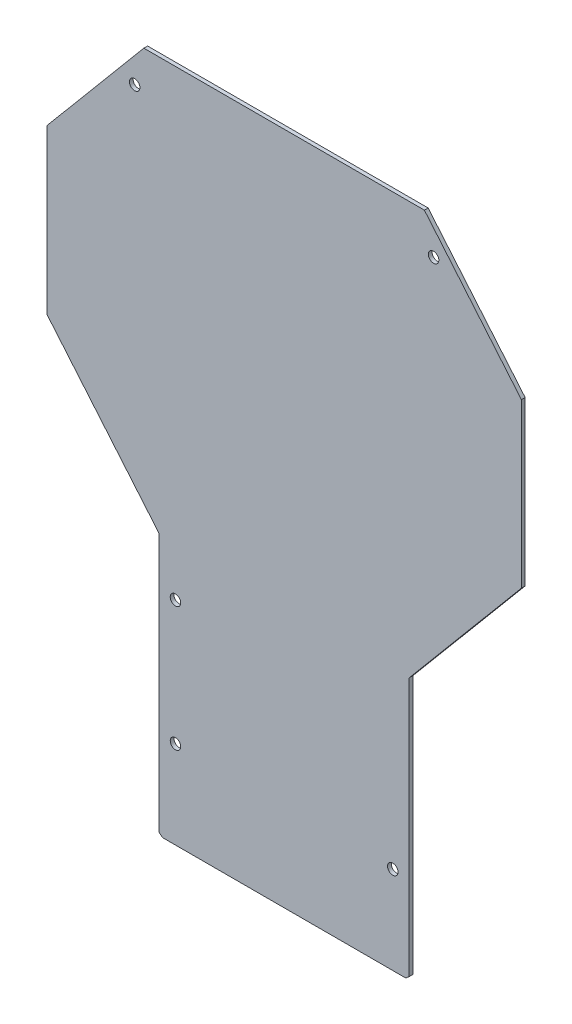
ISO-10303-21;
HEADER;
FILE_DESCRIPTION(('STEP AP214'),'2;1');
FILE_NAME('part.step','',(''),(''),'','','');
FILE_SCHEMA(('AUTOMOTIVE_DESIGN { 1 0 10303 214 1 1 1 1 }'));
ENDSEC;
DATA;
#1=APPLICATION_CONTEXT('core data for automotive mechanical design processes');
#2=APPLICATION_PROTOCOL_DEFINITION('international standard','automotive_design',2000,#1);
#3=PRODUCT_CONTEXT('',#1,'mechanical');
#4=PRODUCT('Part','Part','',(#3));
#5=PRODUCT_RELATED_PRODUCT_CATEGORY('part','',(#4));
#6=PRODUCT_DEFINITION_FORMATION('','',#4);
#7=PRODUCT_DEFINITION_CONTEXT('part definition',#1,'design');
#8=PRODUCT_DEFINITION('design','',#6,#7);
#9=PRODUCT_DEFINITION_SHAPE('','',#8);
#10=(LENGTH_UNIT() NAMED_UNIT(*) SI_UNIT(.MILLI.,.METRE.));
#11=(NAMED_UNIT(*) PLANE_ANGLE_UNIT() SI_UNIT($,.RADIAN.));
#12=(NAMED_UNIT(*) SI_UNIT($,.STERADIAN.) SOLID_ANGLE_UNIT());
#13=UNCERTAINTY_MEASURE_WITH_UNIT(LENGTH_MEASURE(1.E-05),#10,'distance_accuracy_value','');
#14=(GEOMETRIC_REPRESENTATION_CONTEXT(3) GLOBAL_UNCERTAINTY_ASSIGNED_CONTEXT((#13)) GLOBAL_UNIT_ASSIGNED_CONTEXT((#10,
#11,#12)) REPRESENTATION_CONTEXT('',''));
#15=CARTESIAN_POINT('',(0.,0.,0.));
#16=DIRECTION('',(0.,0.,1.));
#17=DIRECTION('',(1.,0.,0.));
#18=AXIS2_PLACEMENT_3D('',#15,#16,#17);
#19=CARTESIAN_POINT('',(49.1570232721275,-31.4887292628743,1.5));
#20=DIRECTION('',(-1.,0.,0.));
#21=DIRECTION('',(0.,-1.,0.));
#22=AXIS2_PLACEMENT_3D('',#19,#20,#21);
#23=PLANE('',#22);
#24=DIRECTION('',(0.,1.,0.));
#25=VECTOR('',#24,1.);
#26=CARTESIAN_POINT('',(49.1570232721275,-31.4887292628743,0.));
#27=LINE('',#26,#25);
#28=CARTESIAN_POINT('',(49.1570232721276,-135.082673957974,0.));
#29=VERTEX_POINT('',#28);
#30=CARTESIAN_POINT('',(49.1570232721275,-31.4887292628743,0.));
#31=VERTEX_POINT('',#30);
#32=EDGE_CURVE('E152',#29,#31,#27,.T.);
#33=ORIENTED_EDGE('',*,*,#32,.T.);
#34=DIRECTION('',(0.,0.,-1.));
#35=VECTOR('',#34,1.);
#36=CARTESIAN_POINT('',(49.1570232721275,-31.4887292628743,1.5));
#37=LINE('',#36,#35);
#38=CARTESIAN_POINT('',(49.1570232721275,-31.4887292628743,1.5));
#39=VERTEX_POINT('',#38);
#40=EDGE_CURVE('E11',#39,#31,#37,.T.);
#41=ORIENTED_EDGE('',*,*,#40,.F.);
#42=DIRECTION('',(0.,1.,0.));
#43=VECTOR('',#42,1.);
#44=CARTESIAN_POINT('',(49.1570232721275,-31.4887292628743,1.5));
#45=LINE('',#44,#43);
#46=CARTESIAN_POINT('',(49.1570232721276,-135.082673957974,1.5));
#47=VERTEX_POINT('',#46);
#48=EDGE_CURVE('E175',#47,#39,#45,.T.);
#49=ORIENTED_EDGE('',*,*,#48,.F.);
#50=DIRECTION('',(0.,0.,-1.));
#51=VECTOR('',#50,1.);
#52=CARTESIAN_POINT('',(49.1570232721276,-135.082673957974,1.5));
#53=LINE('',#52,#51);
#54=EDGE_CURVE('E148',#47,#29,#53,.T.);
#55=ORIENTED_EDGE('',*,*,#54,.T.);
#56=EDGE_LOOP('',(#33,#41,#49,#55));
#57=FACE_BOUND('',#56,.T.);
#58=ADVANCED_FACE('F32',(#57),#23,.F.);
#59=CARTESIAN_POINT('',(94.1570232721273,22.1401824038646,1.5));
#60=DIRECTION('',(-0.766044443118977,0.642787609686541,0.));
#61=DIRECTION('',(-0.642787609686541,-0.766044443118977,0.));
#62=AXIS2_PLACEMENT_3D('',#59,#60,#61);
#63=PLANE('',#62);
#64=DIRECTION('',(0.642787609686541,0.766044443118977,0.));
#65=VECTOR('',#64,1.);
#66=CARTESIAN_POINT('',(94.1570232721273,22.1401824038646,0.));
#67=LINE('',#66,#65);
#68=CARTESIAN_POINT('',(94.1570232721273,22.1401824038646,0.));
#69=VERTEX_POINT('',#68);
#70=EDGE_CURVE('E155',#31,#69,#67,.T.);
#71=ORIENTED_EDGE('',*,*,#70,.T.);
#72=DIRECTION('',(0.,0.,-1.));
#73=VECTOR('',#72,1.);
#74=CARTESIAN_POINT('',(94.1570232721273,22.1401824038646,1.5));
#75=LINE('',#74,#73);
#76=CARTESIAN_POINT('',(94.1570232721273,22.1401824038646,1.5));
#77=VERTEX_POINT('',#76);
#78=EDGE_CURVE('E40',#77,#69,#75,.T.);
#79=ORIENTED_EDGE('',*,*,#78,.F.);
#80=DIRECTION('',(0.642787609686541,0.766044443118977,0.));
#81=VECTOR('',#80,1.);
#82=CARTESIAN_POINT('',(94.1570232721273,22.1401824038646,1.5));
#83=LINE('',#82,#81);
#84=EDGE_CURVE('E103',#39,#77,#83,.T.);
#85=ORIENTED_EDGE('',*,*,#84,.F.);
#86=ORIENTED_EDGE('',*,*,#40,.T.);
#87=EDGE_LOOP('',(#71,#79,#85,#86));
#88=FACE_BOUND('',#87,.T.);
#89=ADVANCED_FACE('F254',(#88),#63,.F.);
#90=CARTESIAN_POINT('',(94.1570232721273,87.5266959780915,1.5));
#91=DIRECTION('',(-1.,0.,0.));
#92=DIRECTION('',(0.,-1.,0.));
#93=AXIS2_PLACEMENT_3D('',#90,#91,#92);
#94=PLANE('',#93);
#95=DIRECTION('',(0.,1.,0.));
#96=VECTOR('',#95,1.);
#97=CARTESIAN_POINT('',(94.1570232721273,87.5266959780915,0.));
#98=LINE('',#97,#96);
#99=CARTESIAN_POINT('',(94.1570232721273,87.5266959780915,0.));
#100=VERTEX_POINT('',#99);
#101=EDGE_CURVE('E158',#69,#100,#98,.T.);
#102=ORIENTED_EDGE('',*,*,#101,.T.);
#103=DIRECTION('',(0.,0.,-1.));
#104=VECTOR('',#103,1.);
#105=CARTESIAN_POINT('',(94.1570232721273,87.5266959780915,1.5));
#106=LINE('',#105,#104);
#107=CARTESIAN_POINT('',(94.1570232721273,87.5266959780915,1.5));
#108=VERTEX_POINT('',#107);
#109=EDGE_CURVE('E194',#108,#100,#106,.T.);
#110=ORIENTED_EDGE('',*,*,#109,.F.);
#111=DIRECTION('',(0.,1.,0.));
#112=VECTOR('',#111,1.);
#113=CARTESIAN_POINT('',(94.1570232721273,87.5266959780915,1.5));
#114=LINE('',#113,#112);
#115=EDGE_CURVE('E202',#77,#108,#114,.T.);
#116=ORIENTED_EDGE('',*,*,#115,.F.);
#117=ORIENTED_EDGE('',*,*,#78,.T.);
#118=EDGE_LOOP('',(#102,#110,#116,#117));
#119=FACE_BOUND('',#118,.T.);
#120=ADVANCED_FACE('F200',(#119),#94,.F.);
#121=CARTESIAN_POINT('',(55.3210460022655,133.809611411357,1.5));
#122=DIRECTION('',(-0.766044443118982,-0.642787609686534,0.));
#123=DIRECTION('',(0.642787609686534,-0.766044443118983,0.));
#124=AXIS2_PLACEMENT_3D('',#121,#122,#123);
#125=PLANE('',#124);
#126=DIRECTION('',(-0.642787609686534,0.766044443118982,0.));
#127=VECTOR('',#126,1.);
#128=CARTESIAN_POINT('',(55.3210460022655,133.809611411357,0.));
#129=LINE('',#128,#127);
#130=CARTESIAN_POINT('',(55.3210460022655,133.809611411357,0.));
#131=VERTEX_POINT('',#130);
#132=EDGE_CURVE('E160',#100,#131,#129,.T.);
#133=ORIENTED_EDGE('',*,*,#132,.T.);
#134=DIRECTION('',(0.,0.,-1.));
#135=VECTOR('',#134,1.);
#136=CARTESIAN_POINT('',(55.3210460022655,133.809611411357,1.5));
#137=LINE('',#136,#135);
#138=CARTESIAN_POINT('',(55.3210460022655,133.809611411357,1.5));
#139=VERTEX_POINT('',#138);
#140=EDGE_CURVE('E191',#139,#131,#137,.T.);
#141=ORIENTED_EDGE('',*,*,#140,.F.);
#142=DIRECTION('',(-0.642787609686534,0.766044443118982,0.));
#143=VECTOR('',#142,1.);
#144=CARTESIAN_POINT('',(55.3210460022655,133.809611411357,1.5));
#145=LINE('',#144,#143);
#146=EDGE_CURVE('E220',#108,#139,#145,.T.);
#147=ORIENTED_EDGE('',*,*,#146,.F.);
#148=ORIENTED_EDGE('',*,*,#109,.T.);
#149=EDGE_LOOP('',(#133,#141,#147,#148));
#150=FACE_BOUND('',#149,.T.);
#151=ADVANCED_FACE('F211',(#150),#125,.F.);
#152=CARTESIAN_POINT('',(55.3210460022655,133.809611411357,1.5));
#153=DIRECTION('',(0.,-1.,0.));
#154=DIRECTION('',(0.,0.,-1.));
#155=AXIS2_PLACEMENT_3D('',#152,#153,#154);
#156=PLANE('',#155);
#157=DIRECTION('',(-1.,0.,0.));
#158=VECTOR('',#157,1.);
#159=CARTESIAN_POINT('',(55.3210460022655,133.809611411357,0.));
#160=LINE('',#159,#158);
#161=CARTESIAN_POINT('',(-57.0069994580103,133.809611411357,0.));
#162=VERTEX_POINT('',#161);
#163=EDGE_CURVE('E162',#131,#162,#160,.T.);
#164=ORIENTED_EDGE('',*,*,#163,.T.);
#165=DIRECTION('',(0.,0.,-1.));
#166=VECTOR('',#165,1.);
#167=CARTESIAN_POINT('',(-57.0069994580103,133.809611411357,1.5));
#168=LINE('',#167,#166);
#169=CARTESIAN_POINT('',(-57.0069994580103,133.809611411357,1.5));
#170=VERTEX_POINT('',#169);
#171=EDGE_CURVE('E188',#170,#162,#168,.T.);
#172=ORIENTED_EDGE('',*,*,#171,.F.);
#173=DIRECTION('',(-1.,0.,0.));
#174=VECTOR('',#173,1.);
#175=CARTESIAN_POINT('',(55.3210460022655,133.809611411357,1.5));
#176=LINE('',#175,#174);
#177=EDGE_CURVE('E217',#139,#170,#176,.T.);
#178=ORIENTED_EDGE('',*,*,#177,.F.);
#179=ORIENTED_EDGE('',*,*,#140,.T.);
#180=EDGE_LOOP('',(#164,#172,#178,#179));
#181=FACE_BOUND('',#180,.T.);
#182=ADVANCED_FACE('F215',(#181),#156,.F.);
#183=CARTESIAN_POINT('',(-57.0069994580103,133.809611411357,1.5));
#184=DIRECTION('',(0.766044443118982,-0.642787609686534,0.));
#185=DIRECTION('',(0.642787609686534,0.766044443118983,0.));
#186=AXIS2_PLACEMENT_3D('',#183,#184,#185);
#187=PLANE('',#186);
#188=DIRECTION('',(-0.642787609686534,-0.766044443118982,0.));
#189=VECTOR('',#188,1.);
#190=CARTESIAN_POINT('',(-57.0069994580103,133.809611411357,0.));
#191=LINE('',#190,#189);
#192=CARTESIAN_POINT('',(-95.8429767278721,87.5266959780915,0.));
#193=VERTEX_POINT('',#192);
#194=EDGE_CURVE('E164',#162,#193,#191,.T.);
#195=ORIENTED_EDGE('',*,*,#194,.T.);
#196=DIRECTION('',(0.,0.,-1.));
#197=VECTOR('',#196,1.);
#198=CARTESIAN_POINT('',(-95.8429767278721,87.5266959780915,1.5));
#199=LINE('',#198,#197);
#200=CARTESIAN_POINT('',(-95.8429767278721,87.5266959780915,1.5));
#201=VERTEX_POINT('',#200);
#202=EDGE_CURVE('E185',#201,#193,#199,.T.);
#203=ORIENTED_EDGE('',*,*,#202,.F.);
#204=DIRECTION('',(-0.642787609686534,-0.766044443118982,0.));
#205=VECTOR('',#204,1.);
#206=CARTESIAN_POINT('',(-57.0069994580103,133.809611411357,1.5));
#207=LINE('',#206,#205);
#208=EDGE_CURVE('E219',#170,#201,#207,.T.);
#209=ORIENTED_EDGE('',*,*,#208,.F.);
#210=ORIENTED_EDGE('',*,*,#171,.T.);
#211=EDGE_LOOP('',(#195,#203,#209,#210));
#212=FACE_BOUND('',#211,.T.);
#213=ADVANCED_FACE('F267',(#212),#187,.F.);
#214=CARTESIAN_POINT('',(-95.8429767278721,87.5266959780915,1.5));
#215=DIRECTION('',(1.,0.,0.));
#216=DIRECTION('',(0.,1.,0.));
#217=AXIS2_PLACEMENT_3D('',#214,#215,#216);
#218=PLANE('',#217);
#219=DIRECTION('',(0.,-1.,0.));
#220=VECTOR('',#219,1.);
#221=CARTESIAN_POINT('',(-95.8429767278721,87.5266959780915,0.));
#222=LINE('',#221,#220);
#223=CARTESIAN_POINT('',(-95.8429767278721,22.1401824038646,0.));
#224=VERTEX_POINT('',#223);
#225=EDGE_CURVE('E166',#193,#224,#222,.T.);
#226=ORIENTED_EDGE('',*,*,#225,.T.);
#227=DIRECTION('',(0.,0.,-1.));
#228=VECTOR('',#227,1.);
#229=CARTESIAN_POINT('',(-95.8429767278721,22.1401824038646,1.5));
#230=LINE('',#229,#228);
#231=CARTESIAN_POINT('',(-95.8429767278721,22.1401824038646,1.5));
#232=VERTEX_POINT('',#231);
#233=EDGE_CURVE('E182',#232,#224,#230,.T.);
#234=ORIENTED_EDGE('',*,*,#233,.F.);
#235=DIRECTION('',(0.,-1.,0.));
#236=VECTOR('',#235,1.);
#237=CARTESIAN_POINT('',(-95.8429767278721,87.5266959780915,1.5));
#238=LINE('',#237,#236);
#239=EDGE_CURVE('E222',#201,#232,#238,.T.);
#240=ORIENTED_EDGE('',*,*,#239,.F.);
#241=ORIENTED_EDGE('',*,*,#202,.T.);
#242=EDGE_LOOP('',(#226,#234,#240,#241));
#243=FACE_BOUND('',#242,.T.);
#244=ADVANCED_FACE('F270',(#243),#218,.F.);
#245=CARTESIAN_POINT('',(-95.8429767278721,22.1401824038646,1.5));
#246=DIRECTION('',(0.766044443118977,0.642787609686541,0.));
#247=DIRECTION('',(-0.642787609686541,0.766044443118977,0.));
#248=AXIS2_PLACEMENT_3D('',#245,#246,#247);
#249=PLANE('',#248);
#250=DIRECTION('',(0.642787609686541,-0.766044443118977,0.));
#251=VECTOR('',#250,1.);
#252=CARTESIAN_POINT('',(-95.8429767278721,22.1401824038646,0.));
#253=LINE('',#252,#251);
#254=CARTESIAN_POINT('',(-50.8429767278723,-31.4887292628743,0.));
#255=VERTEX_POINT('',#254);
#256=EDGE_CURVE('E168',#224,#255,#253,.T.);
#257=ORIENTED_EDGE('',*,*,#256,.T.);
#258=DIRECTION('',(0.,0.,-1.));
#259=VECTOR('',#258,1.);
#260=CARTESIAN_POINT('',(-50.8429767278723,-31.4887292628743,1.5));
#261=LINE('',#260,#259);
#262=CARTESIAN_POINT('',(-50.8429767278723,-31.4887292628743,1.5));
#263=VERTEX_POINT('',#262);
#264=EDGE_CURVE('E179',#263,#255,#261,.T.);
#265=ORIENTED_EDGE('',*,*,#264,.F.);
#266=DIRECTION('',(0.642787609686541,-0.766044443118977,0.));
#267=VECTOR('',#266,1.);
#268=CARTESIAN_POINT('',(-95.8429767278721,22.1401824038646,1.5));
#269=LINE('',#268,#267);
#270=EDGE_CURVE('E228',#232,#263,#269,.T.);
#271=ORIENTED_EDGE('',*,*,#270,.F.);
#272=ORIENTED_EDGE('',*,*,#233,.T.);
#273=EDGE_LOOP('',(#257,#265,#271,#272));
#274=FACE_BOUND('',#273,.T.);
#275=ADVANCED_FACE('F234',(#274),#249,.F.);
#276=CARTESIAN_POINT('',(-50.8429767278723,-31.4887292628743,1.5));
#277=DIRECTION('',(1.,0.,0.));
#278=DIRECTION('',(0.,1.,0.));
#279=AXIS2_PLACEMENT_3D('',#276,#277,#278);
#280=PLANE('',#279);
#281=DIRECTION('',(0.,-1.,0.));
#282=VECTOR('',#281,1.);
#283=CARTESIAN_POINT('',(-50.8429767278723,-31.4887292628743,0.));
#284=LINE('',#283,#282);
#285=CARTESIAN_POINT('',(-50.8429767278723,-135.082673957974,0.));
#286=VERTEX_POINT('',#285);
#287=EDGE_CURVE('E170',#255,#286,#284,.T.);
#288=ORIENTED_EDGE('',*,*,#287,.T.);
#289=DIRECTION('',(0.,0.,-1.));
#290=VECTOR('',#289,1.);
#291=CARTESIAN_POINT('',(-50.8429767278723,-135.082673957974,1.5));
#292=LINE('',#291,#290);
#293=CARTESIAN_POINT('',(-50.8429767278723,-135.082673957974,1.5));
#294=VERTEX_POINT('',#293);
#295=EDGE_CURVE('E143',#294,#286,#292,.T.);
#296=ORIENTED_EDGE('',*,*,#295,.F.);
#297=DIRECTION('',(0.,-1.,0.));
#298=VECTOR('',#297,1.);
#299=CARTESIAN_POINT('',(-50.8429767278723,-31.4887292628743,1.5));
#300=LINE('',#299,#298);
#301=EDGE_CURVE('E134',#263,#294,#300,.T.);
#302=ORIENTED_EDGE('',*,*,#301,.F.);
#303=ORIENTED_EDGE('',*,*,#264,.T.);
#304=EDGE_LOOP('',(#288,#296,#302,#303));
#305=FACE_BOUND('',#304,.T.);
#306=ADVANCED_FACE('F238',(#305),#280,.F.);
#307=CARTESIAN_POINT('',(-50.8429767278723,-135.082673957974,1.5));
#308=DIRECTION('',(0.642787609686518,0.766044443118996,0.));
#309=DIRECTION('',(-0.766044443118996,0.642787609686518,0.));
#310=AXIS2_PLACEMENT_3D('',#307,#308,#309);
#311=PLANE('',#310);
#312=DIRECTION('',(0.766044443118996,-0.642787609686518,0.));
#313=VECTOR('',#312,1.);
#314=CARTESIAN_POINT('',(-50.8429767278723,-135.082673957974,0.));
#315=LINE('',#314,#313);
#316=CARTESIAN_POINT('',(-49.5228538372032,-136.190388588643,0.));
#317=VERTEX_POINT('',#316);
#318=EDGE_CURVE('E142',#286,#317,#315,.T.);
#319=ORIENTED_EDGE('',*,*,#318,.T.);
#320=DIRECTION('',(0.,0.,-1.));
#321=VECTOR('',#320,1.);
#322=CARTESIAN_POINT('',(-49.5228538372032,-136.190388588643,1.5));
#323=LINE('',#322,#321);
#324=CARTESIAN_POINT('',(-49.5228538372032,-136.190388588643,1.5));
#325=VERTEX_POINT('',#324);
#326=EDGE_CURVE('E139',#325,#317,#323,.T.);
#327=ORIENTED_EDGE('',*,*,#326,.F.);
#328=DIRECTION('',(0.766044443118996,-0.642787609686518,0.));
#329=VECTOR('',#328,1.);
#330=CARTESIAN_POINT('',(-50.8429767278723,-135.082673957974,1.5));
#331=LINE('',#330,#329);
#332=EDGE_CURVE('E128',#294,#325,#331,.T.);
#333=ORIENTED_EDGE('',*,*,#332,.F.);
#334=ORIENTED_EDGE('',*,*,#295,.T.);
#335=EDGE_LOOP('',(#319,#327,#333,#334));
#336=FACE_BOUND('',#335,.T.);
#337=ADVANCED_FACE('F140',(#336),#311,.F.);
#338=CARTESIAN_POINT('',(-49.5228538372032,-136.190388588643,1.5));
#339=DIRECTION('',(0.,1.,0.));
#340=DIRECTION('',(-1.,0.,0.));
#341=AXIS2_PLACEMENT_3D('',#338,#339,#340);
#342=PLANE('',#341);
#343=DIRECTION('',(1.,0.,0.));
#344=VECTOR('',#343,1.);
#345=CARTESIAN_POINT('',(-49.5228538372032,-136.190388588643,0.));
#346=LINE('',#345,#344);
#347=CARTESIAN_POINT('',(47.8369003814585,-136.190388588643,0.));
#348=VERTEX_POINT('',#347);
#349=EDGE_CURVE('E89',#317,#348,#346,.T.);
#350=ORIENTED_EDGE('',*,*,#349,.T.);
#351=DIRECTION('',(0.,0.,-1.));
#352=VECTOR('',#351,1.);
#353=CARTESIAN_POINT('',(47.8369003814585,-136.190388588643,1.5));
#354=LINE('',#353,#352);
#355=CARTESIAN_POINT('',(47.8369003814585,-136.190388588643,1.5));
#356=VERTEX_POINT('',#355);
#357=EDGE_CURVE('E144',#356,#348,#354,.T.);
#358=ORIENTED_EDGE('',*,*,#357,.F.);
#359=DIRECTION('',(1.,0.,0.));
#360=VECTOR('',#359,1.);
#361=CARTESIAN_POINT('',(-49.5228538372032,-136.190388588643,1.5));
#362=LINE('',#361,#360);
#363=EDGE_CURVE('E132',#325,#356,#362,.T.);
#364=ORIENTED_EDGE('',*,*,#363,.F.);
#365=ORIENTED_EDGE('',*,*,#326,.T.);
#366=EDGE_LOOP('',(#350,#358,#364,#365));
#367=FACE_BOUND('',#366,.T.);
#368=ADVANCED_FACE('F146',(#367),#342,.F.);
#369=CARTESIAN_POINT('',(49.1570232721276,-135.082673957974,1.5));
#370=DIRECTION('',(-0.642787609686531,0.766044443118985,0.));
#371=DIRECTION('',(-0.766044443118985,-0.642787609686531,0.));
#372=AXIS2_PLACEMENT_3D('',#369,#370,#371);
#373=PLANE('',#372);
#374=DIRECTION('',(0.766044443118985,0.642787609686531,0.));
#375=VECTOR('',#374,1.);
#376=CARTESIAN_POINT('',(49.1570232721276,-135.082673957974,0.));
#377=LINE('',#376,#375);
#378=EDGE_CURVE('E95',#348,#29,#377,.T.);
#379=ORIENTED_EDGE('',*,*,#378,.T.);
#380=ORIENTED_EDGE('',*,*,#54,.F.);
#381=DIRECTION('',(0.766044443118985,0.642787609686531,0.));
#382=VECTOR('',#381,1.);
#383=CARTESIAN_POINT('',(49.1570232721276,-135.082673957974,1.5));
#384=LINE('',#383,#382);
#385=EDGE_CURVE('E48',#356,#47,#384,.T.);
#386=ORIENTED_EDGE('',*,*,#385,.F.);
#387=ORIENTED_EDGE('',*,*,#357,.T.);
#388=EDGE_LOOP('',(#379,#380,#386,#387));
#389=FACE_BOUND('',#388,.T.);
#390=ADVANCED_FACE('F242',(#389),#373,.F.);
#391=CARTESIAN_POINT('',(0.,0.,1.5));
#392=DIRECTION('',(0.,0.,1.));
#393=DIRECTION('',(1.,0.,0.));
#394=AXIS2_PLACEMENT_3D('',#391,#392,#393);
#395=PLANE('',#394);
#396=CARTESIAN_POINT('',(-44.3429767278723,-51.1903885886428,1.5));
#397=DIRECTION('',(0.,0.,1.));
#398=DIRECTION('',(1.,0.,0.));
#399=AXIS2_PLACEMENT_3D('',#396,#397,#398);
#400=CIRCLE('',#399,2.1);
#401=CARTESIAN_POINT('',(-42.2429767278723,-51.1903885886428,1.5));
#402=VERTEX_POINT('',#401);
#403=EDGE_CURVE('E363',#402,#402,#400,.T.);
#404=ORIENTED_EDGE('',*,*,#403,.F.);
#405=EDGE_LOOP('',(#404));
#406=FACE_BOUND('',#405,.T.);
#407=CARTESIAN_POINT('',(58.9989798659813,119.314215641357,1.5));
#408=DIRECTION('',(0.,0.,1.));
#409=DIRECTION('',(-1.,0.,0.));
#410=AXIS2_PLACEMENT_3D('',#407,#408,#409);
#411=CIRCLE('',#410,2.09999999999997);
#412=CARTESIAN_POINT('',(56.8989798659813,119.314215641357,1.5));
#413=VERTEX_POINT('',#412);
#414=EDGE_CURVE('E367',#413,#413,#411,.T.);
#415=ORIENTED_EDGE('',*,*,#414,.F.);
#416=EDGE_LOOP('',(#415));
#417=FACE_BOUND('',#416,.T.);
#418=CARTESIAN_POINT('',(-44.3429767278723,-101.030388588643,1.5));
#419=DIRECTION('',(0.,0.,1.));
#420=DIRECTION('',(1.,0.,0.));
#421=AXIS2_PLACEMENT_3D('',#418,#419,#420);
#422=CIRCLE('',#421,2.1);
#423=CARTESIAN_POINT('',(-42.2429767278723,-101.030388588643,1.5));
#424=VERTEX_POINT('',#423);
#425=EDGE_CURVE('E376',#424,#424,#422,.T.);
#426=ORIENTED_EDGE('',*,*,#425,.F.);
#427=EDGE_LOOP('',(#426));
#428=FACE_BOUND('',#427,.T.);
#429=CARTESIAN_POINT('',(-60.684933321726,119.314215641357,1.5));
#430=DIRECTION('',(0.,0.,1.));
#431=DIRECTION('',(1.,0.,0.));
#432=AXIS2_PLACEMENT_3D('',#429,#430,#431);
#433=CIRCLE('',#432,2.1);
#434=CARTESIAN_POINT('',(-58.584933321726,119.314215641357,1.5));
#435=VERTEX_POINT('',#434);
#436=EDGE_CURVE('E382',#435,#435,#433,.T.);
#437=ORIENTED_EDGE('',*,*,#436,.F.);
#438=EDGE_LOOP('',(#437));
#439=FACE_BOUND('',#438,.T.);
#440=CARTESIAN_POINT('',(42.6570232721276,-101.030388588643,1.5));
#441=DIRECTION('',(0.,0.,1.));
#442=DIRECTION('',(-1.,0.,0.));
#443=AXIS2_PLACEMENT_3D('',#440,#441,#442);
#444=CIRCLE('',#443,2.1);
#445=CARTESIAN_POINT('',(40.5570232721276,-101.030388588643,1.5));
#446=VERTEX_POINT('',#445);
#447=EDGE_CURVE('E388',#446,#446,#444,.T.);
#448=ORIENTED_EDGE('',*,*,#447,.F.);
#449=EDGE_LOOP('',(#448));
#450=FACE_BOUND('',#449,.T.);
#451=ORIENTED_EDGE('',*,*,#48,.T.);
#452=ORIENTED_EDGE('',*,*,#84,.T.);
#453=ORIENTED_EDGE('',*,*,#115,.T.);
#454=ORIENTED_EDGE('',*,*,#146,.T.);
#455=ORIENTED_EDGE('',*,*,#177,.T.);
#456=ORIENTED_EDGE('',*,*,#208,.T.);
#457=ORIENTED_EDGE('',*,*,#239,.T.);
#458=ORIENTED_EDGE('',*,*,#270,.T.);
#459=ORIENTED_EDGE('',*,*,#301,.T.);
#460=ORIENTED_EDGE('',*,*,#332,.T.);
#461=ORIENTED_EDGE('',*,*,#363,.T.);
#462=ORIENTED_EDGE('',*,*,#385,.T.);
#463=EDGE_LOOP('',(#451,#452,#453,#454,#455,#456,#457,#458,#459,#460,#461,#462));
#464=FACE_BOUND('',#463,.T.);
#465=ADVANCED_FACE('F130',(#406,#417,#428,#439,#450,#464),#395,.T.);
#466=CARTESIAN_POINT('',(0.,0.,0.));
#467=DIRECTION('',(0.,0.,1.));
#468=DIRECTION('',(1.,0.,0.));
#469=AXIS2_PLACEMENT_3D('',#466,#467,#468);
#470=PLANE('',#469);
#471=CARTESIAN_POINT('',(-44.3429767278723,-51.1903885886428,0.));
#472=DIRECTION('',(0.,0.,1.));
#473=DIRECTION('',(1.,0.,0.));
#474=AXIS2_PLACEMENT_3D('',#471,#472,#473);
#475=CIRCLE('',#474,2.1);
#476=CARTESIAN_POINT('',(-42.2429767278723,-51.1903885886428,0.));
#477=VERTEX_POINT('',#476);
#478=EDGE_CURVE('E366',#477,#477,#475,.F.);
#479=ORIENTED_EDGE('',*,*,#478,.F.);
#480=EDGE_LOOP('',(#479));
#481=FACE_BOUND('',#480,.T.);
#482=CARTESIAN_POINT('',(58.9989798659813,119.314215641357,0.));
#483=DIRECTION('',(0.,0.,1.));
#484=DIRECTION('',(1.,0.,0.));
#485=AXIS2_PLACEMENT_3D('',#482,#483,#484);
#486=CIRCLE('',#485,2.09999999999997);
#487=CARTESIAN_POINT('',(61.0989798659813,119.314215641357,0.));
#488=VERTEX_POINT('',#487);
#489=EDGE_CURVE('E370',#488,#488,#486,.F.);
#490=ORIENTED_EDGE('',*,*,#489,.F.);
#491=EDGE_LOOP('',(#490));
#492=FACE_BOUND('',#491,.T.);
#493=CARTESIAN_POINT('',(-44.3429767278723,-101.030388588643,0.));
#494=DIRECTION('',(0.,0.,1.));
#495=DIRECTION('',(1.,0.,0.));
#496=AXIS2_PLACEMENT_3D('',#493,#494,#495);
#497=CIRCLE('',#496,2.1);
#498=CARTESIAN_POINT('',(-42.2429767278723,-101.030388588643,0.));
#499=VERTEX_POINT('',#498);
#500=EDGE_CURVE('E379',#499,#499,#497,.F.);
#501=ORIENTED_EDGE('',*,*,#500,.F.);
#502=EDGE_LOOP('',(#501));
#503=FACE_BOUND('',#502,.T.);
#504=CARTESIAN_POINT('',(-60.684933321726,119.314215641357,0.));
#505=DIRECTION('',(0.,0.,1.));
#506=DIRECTION('',(1.,0.,0.));
#507=AXIS2_PLACEMENT_3D('',#504,#505,#506);
#508=CIRCLE('',#507,2.1);
#509=CARTESIAN_POINT('',(-58.584933321726,119.314215641357,0.));
#510=VERTEX_POINT('',#509);
#511=EDGE_CURVE('E385',#510,#510,#508,.F.);
#512=ORIENTED_EDGE('',*,*,#511,.F.);
#513=EDGE_LOOP('',(#512));
#514=FACE_BOUND('',#513,.T.);
#515=CARTESIAN_POINT('',(42.6570232721276,-101.030388588643,0.));
#516=DIRECTION('',(0.,0.,1.));
#517=DIRECTION('',(1.,0.,0.));
#518=AXIS2_PLACEMENT_3D('',#515,#516,#517);
#519=CIRCLE('',#518,2.1);
#520=CARTESIAN_POINT('',(44.7570232721276,-101.030388588643,0.));
#521=VERTEX_POINT('',#520);
#522=EDGE_CURVE('E156',#521,#521,#519,.F.);
#523=ORIENTED_EDGE('',*,*,#522,.F.);
#524=EDGE_LOOP('',(#523));
#525=FACE_BOUND('',#524,.T.);
#526=ORIENTED_EDGE('',*,*,#32,.F.);
#527=ORIENTED_EDGE('',*,*,#378,.F.);
#528=ORIENTED_EDGE('',*,*,#349,.F.);
#529=ORIENTED_EDGE('',*,*,#318,.F.);
#530=ORIENTED_EDGE('',*,*,#287,.F.);
#531=ORIENTED_EDGE('',*,*,#256,.F.);
#532=ORIENTED_EDGE('',*,*,#225,.F.);
#533=ORIENTED_EDGE('',*,*,#194,.F.);
#534=ORIENTED_EDGE('',*,*,#163,.F.);
#535=ORIENTED_EDGE('',*,*,#132,.F.);
#536=ORIENTED_EDGE('',*,*,#101,.F.);
#537=ORIENTED_EDGE('',*,*,#70,.F.);
#538=EDGE_LOOP('',(#526,#527,#528,#529,#530,#531,#532,#533,#534,#535,#536,#537));
#539=FACE_BOUND('',#538,.T.);
#540=ADVANCED_FACE('F206',(#481,#492,#503,#514,#525,#539),#470,.F.);
#541=CARTESIAN_POINT('',(42.6570232721276,-101.030388588643,-0.000999999999999916));
#542=DIRECTION('',(0.,0.,1.));
#543=DIRECTION('',(1.,0.,0.));
#544=AXIS2_PLACEMENT_3D('',#541,#542,#543);
#545=CYLINDRICAL_SURFACE('',#544,2.1);
#546=ORIENTED_EDGE('',*,*,#447,.T.);
#547=EDGE_LOOP('',(#546));
#548=FACE_BOUND('',#547,.T.);
#549=ORIENTED_EDGE('',*,*,#522,.T.);
#550=EDGE_LOOP('',(#549));
#551=FACE_BOUND('',#550,.T.);
#552=ADVANCED_FACE('F307',(#548,#551),#545,.F.);
#553=CARTESIAN_POINT('',(-60.684933321726,119.314215641357,-0.000999999999999916));
#554=DIRECTION('',(0.,0.,1.));
#555=DIRECTION('',(1.,0.,0.));
#556=AXIS2_PLACEMENT_3D('',#553,#554,#555);
#557=CYLINDRICAL_SURFACE('',#556,2.1);
#558=ORIENTED_EDGE('',*,*,#436,.T.);
#559=EDGE_LOOP('',(#558));
#560=FACE_BOUND('',#559,.T.);
#561=ORIENTED_EDGE('',*,*,#511,.T.);
#562=EDGE_LOOP('',(#561));
#563=FACE_BOUND('',#562,.T.);
#564=ADVANCED_FACE('F316',(#560,#563),#557,.F.);
#565=CARTESIAN_POINT('',(-44.3429767278723,-101.030388588643,-0.000999999999999916));
#566=DIRECTION('',(0.,0.,1.));
#567=DIRECTION('',(1.,0.,0.));
#568=AXIS2_PLACEMENT_3D('',#565,#566,#567);
#569=CYLINDRICAL_SURFACE('',#568,2.1);
#570=ORIENTED_EDGE('',*,*,#425,.T.);
#571=EDGE_LOOP('',(#570));
#572=FACE_BOUND('',#571,.T.);
#573=ORIENTED_EDGE('',*,*,#500,.T.);
#574=EDGE_LOOP('',(#573));
#575=FACE_BOUND('',#574,.T.);
#576=ADVANCED_FACE('F326',(#572,#575),#569,.F.);
#577=CARTESIAN_POINT('',(58.9989798659813,119.314215641357,-0.000999999999999916));
#578=DIRECTION('',(0.,0.,1.));
#579=DIRECTION('',(1.,0.,0.));
#580=AXIS2_PLACEMENT_3D('',#577,#578,#579);
#581=CYLINDRICAL_SURFACE('',#580,2.09999999999997);
#582=ORIENTED_EDGE('',*,*,#414,.T.);
#583=EDGE_LOOP('',(#582));
#584=FACE_BOUND('',#583,.T.);
#585=ORIENTED_EDGE('',*,*,#489,.T.);
#586=EDGE_LOOP('',(#585));
#587=FACE_BOUND('',#586,.T.);
#588=ADVANCED_FACE('F336',(#584,#587),#581,.F.);
#589=CARTESIAN_POINT('',(-44.3429767278723,-51.1903885886428,-0.000999999999999916));
#590=DIRECTION('',(0.,0.,1.));
#591=DIRECTION('',(1.,0.,0.));
#592=AXIS2_PLACEMENT_3D('',#589,#590,#591);
#593=CYLINDRICAL_SURFACE('',#592,2.1);
#594=ORIENTED_EDGE('',*,*,#403,.T.);
#595=EDGE_LOOP('',(#594));
#596=FACE_BOUND('',#595,.T.);
#597=ORIENTED_EDGE('',*,*,#478,.T.);
#598=EDGE_LOOP('',(#597));
#599=FACE_BOUND('',#598,.T.);
#600=ADVANCED_FACE('F346',(#596,#599),#593,.F.);
#601=CLOSED_SHELL('',(#58,#89,#120,#151,#182,#213,#244,#275,#306,#337,#368,#390,#465,#540,#552,
#564,#576,#588,#600));
#602=MANIFOLD_SOLID_BREP('B2',#601);
#603=ADVANCED_BREP_SHAPE_REPRESENTATION('',(#18,#602),#14);
#604=SHAPE_DEFINITION_REPRESENTATION(#9,#603);
ENDSEC;
END-ISO-10303-21;
